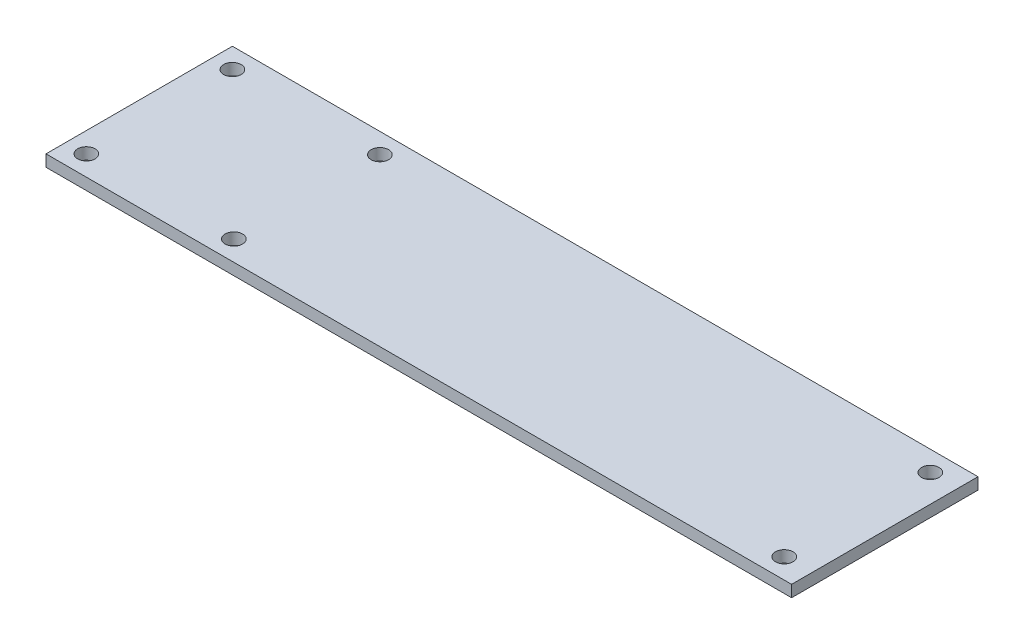
ISO-10303-21;
HEADER;
FILE_DESCRIPTION(('STEP AP214'),'2;1');
FILE_NAME('part.step','',(''),(''),'','','');
FILE_SCHEMA(('AUTOMOTIVE_DESIGN { 1 0 10303 214 1 1 1 1 }'));
ENDSEC;
DATA;
#1=APPLICATION_CONTEXT('core data for automotive mechanical design processes');
#2=APPLICATION_PROTOCOL_DEFINITION('international standard','automotive_design',2000,#1);
#3=PRODUCT_CONTEXT('',#1,'mechanical');
#4=PRODUCT('Part','Part','',(#3));
#5=PRODUCT_RELATED_PRODUCT_CATEGORY('part','',(#4));
#6=PRODUCT_DEFINITION_FORMATION('','',#4);
#7=PRODUCT_DEFINITION_CONTEXT('part definition',#1,'design');
#8=PRODUCT_DEFINITION('design','',#6,#7);
#9=PRODUCT_DEFINITION_SHAPE('','',#8);
#10=(LENGTH_UNIT() NAMED_UNIT(*) SI_UNIT(.MILLI.,.METRE.));
#11=(NAMED_UNIT(*) PLANE_ANGLE_UNIT() SI_UNIT($,.RADIAN.));
#12=(NAMED_UNIT(*) SI_UNIT($,.STERADIAN.) SOLID_ANGLE_UNIT());
#13=UNCERTAINTY_MEASURE_WITH_UNIT(LENGTH_MEASURE(1.E-05),#10,'distance_accuracy_value','');
#14=(GEOMETRIC_REPRESENTATION_CONTEXT(3) GLOBAL_UNCERTAINTY_ASSIGNED_CONTEXT((#13)) GLOBAL_UNIT_ASSIGNED_CONTEXT((#10,
#11,#12)) REPRESENTATION_CONTEXT('',''));
#15=CARTESIAN_POINT('',(0.,0.,0.));
#16=DIRECTION('',(0.,0.,1.));
#17=DIRECTION('',(1.,0.,0.));
#18=AXIS2_PLACEMENT_3D('',#15,#16,#17);
#19=CARTESIAN_POINT('',(203.2,6.35,50.8));
#20=DIRECTION('',(-1.,0.,0.));
#21=DIRECTION('',(0.,0.,1.));
#22=AXIS2_PLACEMENT_3D('',#19,#20,#21);
#23=PLANE('',#22);
#24=DIRECTION('',(0.,0.,-1.));
#25=VECTOR('',#24,1.);
#26=CARTESIAN_POINT('',(203.2,0.,50.8));
#27=LINE('',#26,#25);
#28=CARTESIAN_POINT('',(203.2,0.,50.8));
#29=VERTEX_POINT('',#28);
#30=CARTESIAN_POINT('',(203.2,0.,-50.8));
#31=VERTEX_POINT('',#30);
#32=EDGE_CURVE('E95',#29,#31,#27,.T.);
#33=ORIENTED_EDGE('',*,*,#32,.T.);
#34=DIRECTION('',(0.,-1.,0.));
#35=VECTOR('',#34,1.);
#36=CARTESIAN_POINT('',(203.2,6.35,-50.8));
#37=LINE('',#36,#35);
#38=CARTESIAN_POINT('',(203.2,6.35,-50.8));
#39=VERTEX_POINT('',#38);
#40=EDGE_CURVE('E11',#39,#31,#37,.T.);
#41=ORIENTED_EDGE('',*,*,#40,.F.);
#42=DIRECTION('',(0.,0.,-1.));
#43=VECTOR('',#42,1.);
#44=CARTESIAN_POINT('',(203.2,6.35,50.8));
#45=LINE('',#44,#43);
#46=CARTESIAN_POINT('',(203.2,6.35,50.8));
#47=VERTEX_POINT('',#46);
#48=EDGE_CURVE('E83',#47,#39,#45,.T.);
#49=ORIENTED_EDGE('',*,*,#48,.F.);
#50=DIRECTION('',(0.,-1.,0.));
#51=VECTOR('',#50,1.);
#52=CARTESIAN_POINT('',(203.2,6.35,50.8));
#53=LINE('',#52,#51);
#54=EDGE_CURVE('E91',#47,#29,#53,.T.);
#55=ORIENTED_EDGE('',*,*,#54,.T.);
#56=EDGE_LOOP('',(#33,#41,#49,#55));
#57=FACE_BOUND('',#56,.T.);
#58=ADVANCED_FACE('F32',(#57),#23,.F.);
#59=CARTESIAN_POINT('',(-203.2,6.35,-50.8));
#60=DIRECTION('',(0.,0.,1.));
#61=DIRECTION('',(1.,0.,0.));
#62=AXIS2_PLACEMENT_3D('',#59,#60,#61);
#63=PLANE('',#62);
#64=DIRECTION('',(-1.,0.,0.));
#65=VECTOR('',#64,1.);
#66=CARTESIAN_POINT('',(-203.2,0.,-50.8));
#67=LINE('',#66,#65);
#68=CARTESIAN_POINT('',(-203.2,0.,-50.8));
#69=VERTEX_POINT('',#68);
#70=EDGE_CURVE('E87',#31,#69,#67,.T.);
#71=ORIENTED_EDGE('',*,*,#70,.T.);
#72=DIRECTION('',(0.,-1.,0.));
#73=VECTOR('',#72,1.);
#74=CARTESIAN_POINT('',(-203.2,6.35,-50.8));
#75=LINE('',#74,#73);
#76=CARTESIAN_POINT('',(-203.2,6.35,-50.8));
#77=VERTEX_POINT('',#76);
#78=EDGE_CURVE('E40',#77,#69,#75,.T.);
#79=ORIENTED_EDGE('',*,*,#78,.F.);
#80=DIRECTION('',(-1.,0.,0.));
#81=VECTOR('',#80,1.);
#82=CARTESIAN_POINT('',(-203.2,6.35,-50.8));
#83=LINE('',#82,#81);
#84=EDGE_CURVE('E78',#39,#77,#83,.T.);
#85=ORIENTED_EDGE('',*,*,#84,.F.);
#86=ORIENTED_EDGE('',*,*,#40,.T.);
#87=EDGE_LOOP('',(#71,#79,#85,#86));
#88=FACE_BOUND('',#87,.T.);
#89=ADVANCED_FACE('F86',(#88),#63,.F.);
#90=CARTESIAN_POINT('',(-203.2,6.35,50.8));
#91=DIRECTION('',(1.,0.,0.));
#92=DIRECTION('',(0.,0.,-1.));
#93=AXIS2_PLACEMENT_3D('',#90,#91,#92);
#94=PLANE('',#93);
#95=DIRECTION('',(0.,0.,1.));
#96=VECTOR('',#95,1.);
#97=CARTESIAN_POINT('',(-203.2,0.,50.8));
#98=LINE('',#97,#96);
#99=CARTESIAN_POINT('',(-203.2,0.,50.8));
#100=VERTEX_POINT('',#99);
#101=EDGE_CURVE('E65',#69,#100,#98,.T.);
#102=ORIENTED_EDGE('',*,*,#101,.T.);
#103=DIRECTION('',(0.,-1.,0.));
#104=VECTOR('',#103,1.);
#105=CARTESIAN_POINT('',(-203.2,6.35,50.8));
#106=LINE('',#105,#104);
#107=CARTESIAN_POINT('',(-203.2,6.35,50.8));
#108=VERTEX_POINT('',#107);
#109=EDGE_CURVE('E88',#108,#100,#106,.T.);
#110=ORIENTED_EDGE('',*,*,#109,.F.);
#111=DIRECTION('',(0.,0.,1.));
#112=VECTOR('',#111,1.);
#113=CARTESIAN_POINT('',(-203.2,6.35,50.8));
#114=LINE('',#113,#112);
#115=EDGE_CURVE('E81',#77,#108,#114,.T.);
#116=ORIENTED_EDGE('',*,*,#115,.F.);
#117=ORIENTED_EDGE('',*,*,#78,.T.);
#118=EDGE_LOOP('',(#102,#110,#116,#117));
#119=FACE_BOUND('',#118,.T.);
#120=ADVANCED_FACE('F89',(#119),#94,.F.);
#121=CARTESIAN_POINT('',(-203.2,6.35,50.8));
#122=DIRECTION('',(0.,0.,-1.));
#123=DIRECTION('',(-1.,0.,0.));
#124=AXIS2_PLACEMENT_3D('',#121,#122,#123);
#125=PLANE('',#124);
#126=DIRECTION('',(1.,0.,0.));
#127=VECTOR('',#126,1.);
#128=CARTESIAN_POINT('',(-203.2,0.,50.8));
#129=LINE('',#128,#127);
#130=EDGE_CURVE('E71',#100,#29,#129,.T.);
#131=ORIENTED_EDGE('',*,*,#130,.T.);
#132=ORIENTED_EDGE('',*,*,#54,.F.);
#133=DIRECTION('',(1.,0.,0.));
#134=VECTOR('',#133,1.);
#135=CARTESIAN_POINT('',(-203.2,6.35,50.8));
#136=LINE('',#135,#134);
#137=EDGE_CURVE('E48',#108,#47,#136,.T.);
#138=ORIENTED_EDGE('',*,*,#137,.F.);
#139=ORIENTED_EDGE('',*,*,#109,.T.);
#140=EDGE_LOOP('',(#131,#132,#138,#139));
#141=FACE_BOUND('',#140,.T.);
#142=ADVANCED_FACE('F103',(#141),#125,.F.);
#143=CARTESIAN_POINT('',(0.,6.35,0.));
#144=DIRECTION('',(0.,-1.,0.));
#145=DIRECTION('',(0.,0.,-1.));
#146=AXIS2_PLACEMENT_3D('',#143,#144,#145);
#147=PLANE('',#146);
#148=CARTESIAN_POINT('',(-192.2,6.35,-39.8));
#149=DIRECTION('',(0.,1.,0.));
#150=DIRECTION('',(0.,0.,1.));
#151=AXIS2_PLACEMENT_3D('',#148,#149,#150);
#152=CIRCLE('',#151,4.76250000000001);
#153=CARTESIAN_POINT('',(-192.2,6.35,-35.0375));
#154=VERTEX_POINT('',#153);
#155=EDGE_CURVE('E139',#154,#154,#152,.T.);
#156=ORIENTED_EDGE('',*,*,#155,.F.);
#157=EDGE_LOOP('',(#156));
#158=FACE_BOUND('',#157,.T.);
#159=CARTESIAN_POINT('',(188.2,6.35,-39.8));
#160=DIRECTION('',(0.,1.,0.));
#161=DIRECTION('',(0.,0.,1.));
#162=AXIS2_PLACEMENT_3D('',#159,#160,#161);
#163=CIRCLE('',#162,4.76250000000001);
#164=CARTESIAN_POINT('',(188.2,6.35,-35.0375));
#165=VERTEX_POINT('',#164);
#166=EDGE_CURVE('E133',#165,#165,#163,.T.);
#167=ORIENTED_EDGE('',*,*,#166,.F.);
#168=EDGE_LOOP('',(#167));
#169=FACE_BOUND('',#168,.T.);
#170=CARTESIAN_POINT('',(188.2,6.35,39.8));
#171=DIRECTION('',(0.,1.,0.));
#172=DIRECTION('',(0.,0.,1.));
#173=AXIS2_PLACEMENT_3D('',#170,#171,#172);
#174=CIRCLE('',#173,4.76250000000001);
#175=CARTESIAN_POINT('',(188.2,6.35,44.5625));
#176=VERTEX_POINT('',#175);
#177=EDGE_CURVE('E127',#176,#176,#174,.T.);
#178=ORIENTED_EDGE('',*,*,#177,.F.);
#179=EDGE_LOOP('',(#178));
#180=FACE_BOUND('',#179,.T.);
#181=CARTESIAN_POINT('',(-192.2,6.35,39.8));
#182=DIRECTION('',(0.,1.,0.));
#183=DIRECTION('',(0.,0.,-1.));
#184=AXIS2_PLACEMENT_3D('',#181,#182,#183);
#185=CIRCLE('',#184,4.76250000000001);
#186=CARTESIAN_POINT('',(-192.2,6.35,35.0375));
#187=VERTEX_POINT('',#186);
#188=EDGE_CURVE('E121',#187,#187,#185,.T.);
#189=ORIENTED_EDGE('',*,*,#188,.F.);
#190=EDGE_LOOP('',(#189));
#191=FACE_BOUND('',#190,.T.);
#192=CARTESIAN_POINT('',(-111.81,6.35,39.8));
#193=DIRECTION('',(0.,1.,0.));
#194=DIRECTION('',(0.,0.,-1.));
#195=AXIS2_PLACEMENT_3D('',#192,#193,#194);
#196=CIRCLE('',#195,4.76250000000001);
#197=CARTESIAN_POINT('',(-111.81,6.35,35.0375));
#198=VERTEX_POINT('',#197);
#199=EDGE_CURVE('E115',#198,#198,#196,.T.);
#200=ORIENTED_EDGE('',*,*,#199,.F.);
#201=EDGE_LOOP('',(#200));
#202=FACE_BOUND('',#201,.T.);
#203=CARTESIAN_POINT('',(-111.81,6.35,-39.8));
#204=DIRECTION('',(0.,1.,0.));
#205=DIRECTION('',(0.,0.,1.));
#206=AXIS2_PLACEMENT_3D('',#203,#204,#205);
#207=CIRCLE('',#206,4.76250000000001);
#208=CARTESIAN_POINT('',(-111.81,6.35,-35.0375));
#209=VERTEX_POINT('',#208);
#210=EDGE_CURVE('E109',#209,#209,#207,.T.);
#211=ORIENTED_EDGE('',*,*,#210,.F.);
#212=EDGE_LOOP('',(#211));
#213=FACE_BOUND('',#212,.T.);
#214=ORIENTED_EDGE('',*,*,#48,.T.);
#215=ORIENTED_EDGE('',*,*,#84,.T.);
#216=ORIENTED_EDGE('',*,*,#115,.T.);
#217=ORIENTED_EDGE('',*,*,#137,.T.);
#218=EDGE_LOOP('',(#214,#215,#216,#217));
#219=FACE_BOUND('',#218,.T.);
#220=ADVANCED_FACE('F79',(#158,#169,#180,#191,#202,#213,#219),#147,.F.);
#221=CARTESIAN_POINT('',(0.,0.,0.));
#222=DIRECTION('',(0.,-1.,0.));
#223=DIRECTION('',(0.,0.,-1.));
#224=AXIS2_PLACEMENT_3D('',#221,#222,#223);
#225=PLANE('',#224);
#226=CARTESIAN_POINT('',(-192.2,0.,-39.8));
#227=DIRECTION('',(0.,1.,0.));
#228=DIRECTION('',(0.,0.,1.));
#229=AXIS2_PLACEMENT_3D('',#226,#227,#228);
#230=CIRCLE('',#229,4.76250000000001);
#231=CARTESIAN_POINT('',(-192.2,0.,-35.0375));
#232=VERTEX_POINT('',#231);
#233=EDGE_CURVE('E112',#232,#232,#230,.T.);
#234=ORIENTED_EDGE('',*,*,#233,.T.);
#235=EDGE_LOOP('',(#234));
#236=FACE_BOUND('',#235,.T.);
#237=CARTESIAN_POINT('',(188.2,0.,-39.8));
#238=DIRECTION('',(0.,1.,0.));
#239=DIRECTION('',(0.,0.,1.));
#240=AXIS2_PLACEMENT_3D('',#237,#238,#239);
#241=CIRCLE('',#240,4.76250000000001);
#242=CARTESIAN_POINT('',(188.2,0.,-35.0375));
#243=VERTEX_POINT('',#242);
#244=EDGE_CURVE('E136',#243,#243,#241,.T.);
#245=ORIENTED_EDGE('',*,*,#244,.T.);
#246=EDGE_LOOP('',(#245));
#247=FACE_BOUND('',#246,.T.);
#248=CARTESIAN_POINT('',(188.2,0.,39.8));
#249=DIRECTION('',(0.,1.,0.));
#250=DIRECTION('',(0.,0.,1.));
#251=AXIS2_PLACEMENT_3D('',#248,#249,#250);
#252=CIRCLE('',#251,4.76250000000001);
#253=CARTESIAN_POINT('',(188.2,0.,44.5625));
#254=VERTEX_POINT('',#253);
#255=EDGE_CURVE('E130',#254,#254,#252,.T.);
#256=ORIENTED_EDGE('',*,*,#255,.T.);
#257=EDGE_LOOP('',(#256));
#258=FACE_BOUND('',#257,.T.);
#259=CARTESIAN_POINT('',(-192.2,0.,39.8));
#260=DIRECTION('',(0.,1.,0.));
#261=DIRECTION('',(0.,0.,-1.));
#262=AXIS2_PLACEMENT_3D('',#259,#260,#261);
#263=CIRCLE('',#262,4.76250000000001);
#264=CARTESIAN_POINT('',(-192.2,0.,35.0375));
#265=VERTEX_POINT('',#264);
#266=EDGE_CURVE('E124',#265,#265,#263,.T.);
#267=ORIENTED_EDGE('',*,*,#266,.T.);
#268=EDGE_LOOP('',(#267));
#269=FACE_BOUND('',#268,.T.);
#270=CARTESIAN_POINT('',(-111.81,0.,39.8));
#271=DIRECTION('',(0.,1.,0.));
#272=DIRECTION('',(0.,0.,-1.));
#273=AXIS2_PLACEMENT_3D('',#270,#271,#272);
#274=CIRCLE('',#273,4.76250000000001);
#275=CARTESIAN_POINT('',(-111.81,0.,35.0375));
#276=VERTEX_POINT('',#275);
#277=EDGE_CURVE('E118',#276,#276,#274,.T.);
#278=ORIENTED_EDGE('',*,*,#277,.T.);
#279=EDGE_LOOP('',(#278));
#280=FACE_BOUND('',#279,.T.);
#281=CARTESIAN_POINT('',(-111.81,0.,-39.8));
#282=DIRECTION('',(0.,1.,0.));
#283=DIRECTION('',(0.,0.,1.));
#284=AXIS2_PLACEMENT_3D('',#281,#282,#283);
#285=CIRCLE('',#284,4.76250000000001);
#286=CARTESIAN_POINT('',(-111.81,0.,-35.0375));
#287=VERTEX_POINT('',#286);
#288=EDGE_CURVE('E98',#287,#287,#285,.T.);
#289=ORIENTED_EDGE('',*,*,#288,.T.);
#290=EDGE_LOOP('',(#289));
#291=FACE_BOUND('',#290,.T.);
#292=ORIENTED_EDGE('',*,*,#32,.F.);
#293=ORIENTED_EDGE('',*,*,#130,.F.);
#294=ORIENTED_EDGE('',*,*,#101,.F.);
#295=ORIENTED_EDGE('',*,*,#70,.F.);
#296=EDGE_LOOP('',(#292,#293,#294,#295));
#297=FACE_BOUND('',#296,.T.);
#298=ADVANCED_FACE('F106',(#236,#247,#258,#269,#280,#291,#297),#225,.T.);
#299=CARTESIAN_POINT('',(-111.81,0.,-39.8));
#300=DIRECTION('',(0.,1.,0.));
#301=DIRECTION('',(0.,0.,1.));
#302=AXIS2_PLACEMENT_3D('',#299,#300,#301);
#303=CYLINDRICAL_SURFACE('',#302,4.76250000000001);
#304=ORIENTED_EDGE('',*,*,#288,.F.);
#305=EDGE_LOOP('',(#304));
#306=FACE_BOUND('',#305,.T.);
#307=ORIENTED_EDGE('',*,*,#210,.T.);
#308=EDGE_LOOP('',(#307));
#309=FACE_BOUND('',#308,.T.);
#310=ADVANCED_FACE('F167',(#306,#309),#303,.F.);
#311=CARTESIAN_POINT('',(-111.81,0.,39.8));
#312=DIRECTION('',(0.,1.,0.));
#313=DIRECTION('',(0.,0.,1.));
#314=AXIS2_PLACEMENT_3D('',#311,#312,#313);
#315=CYLINDRICAL_SURFACE('',#314,4.76250000000001);
#316=ORIENTED_EDGE('',*,*,#277,.F.);
#317=EDGE_LOOP('',(#316));
#318=FACE_BOUND('',#317,.T.);
#319=ORIENTED_EDGE('',*,*,#199,.T.);
#320=EDGE_LOOP('',(#319));
#321=FACE_BOUND('',#320,.T.);
#322=ADVANCED_FACE('F169',(#318,#321),#315,.F.);
#323=CARTESIAN_POINT('',(-192.2,0.,39.8));
#324=DIRECTION('',(0.,1.,0.));
#325=DIRECTION('',(0.,0.,1.));
#326=AXIS2_PLACEMENT_3D('',#323,#324,#325);
#327=CYLINDRICAL_SURFACE('',#326,4.76250000000001);
#328=ORIENTED_EDGE('',*,*,#266,.F.);
#329=EDGE_LOOP('',(#328));
#330=FACE_BOUND('',#329,.T.);
#331=ORIENTED_EDGE('',*,*,#188,.T.);
#332=EDGE_LOOP('',(#331));
#333=FACE_BOUND('',#332,.T.);
#334=ADVANCED_FACE('F176',(#330,#333),#327,.F.);
#335=CARTESIAN_POINT('',(188.2,0.,39.8));
#336=DIRECTION('',(0.,1.,0.));
#337=DIRECTION('',(0.,0.,1.));
#338=AXIS2_PLACEMENT_3D('',#335,#336,#337);
#339=CYLINDRICAL_SURFACE('',#338,4.76250000000001);
#340=ORIENTED_EDGE('',*,*,#255,.F.);
#341=EDGE_LOOP('',(#340));
#342=FACE_BOUND('',#341,.T.);
#343=ORIENTED_EDGE('',*,*,#177,.T.);
#344=EDGE_LOOP('',(#343));
#345=FACE_BOUND('',#344,.T.);
#346=ADVANCED_FACE('F222',(#342,#345),#339,.F.);
#347=CARTESIAN_POINT('',(188.2,0.,-39.8));
#348=DIRECTION('',(0.,1.,0.));
#349=DIRECTION('',(0.,0.,1.));
#350=AXIS2_PLACEMENT_3D('',#347,#348,#349);
#351=CYLINDRICAL_SURFACE('',#350,4.76250000000001);
#352=ORIENTED_EDGE('',*,*,#244,.F.);
#353=EDGE_LOOP('',(#352));
#354=FACE_BOUND('',#353,.T.);
#355=ORIENTED_EDGE('',*,*,#166,.T.);
#356=EDGE_LOOP('',(#355));
#357=FACE_BOUND('',#356,.T.);
#358=ADVANCED_FACE('F150',(#354,#357),#351,.F.);
#359=CARTESIAN_POINT('',(-192.2,0.,-39.8));
#360=DIRECTION('',(0.,1.,0.));
#361=DIRECTION('',(0.,0.,1.));
#362=AXIS2_PLACEMENT_3D('',#359,#360,#361);
#363=CYLINDRICAL_SURFACE('',#362,4.76250000000001);
#364=ORIENTED_EDGE('',*,*,#233,.F.);
#365=EDGE_LOOP('',(#364));
#366=FACE_BOUND('',#365,.T.);
#367=ORIENTED_EDGE('',*,*,#155,.T.);
#368=EDGE_LOOP('',(#367));
#369=FACE_BOUND('',#368,.T.);
#370=ADVANCED_FACE('F147',(#366,#369),#363,.F.);
#371=CLOSED_SHELL('',(#58,#89,#120,#142,#220,#298,#310,#322,#334,#346,#358,#370));
#372=MANIFOLD_SOLID_BREP('B2',#371);
#373=ADVANCED_BREP_SHAPE_REPRESENTATION('',(#18,#372),#14);
#374=SHAPE_DEFINITION_REPRESENTATION(#9,#373);
ENDSEC;
END-ISO-10303-21;
